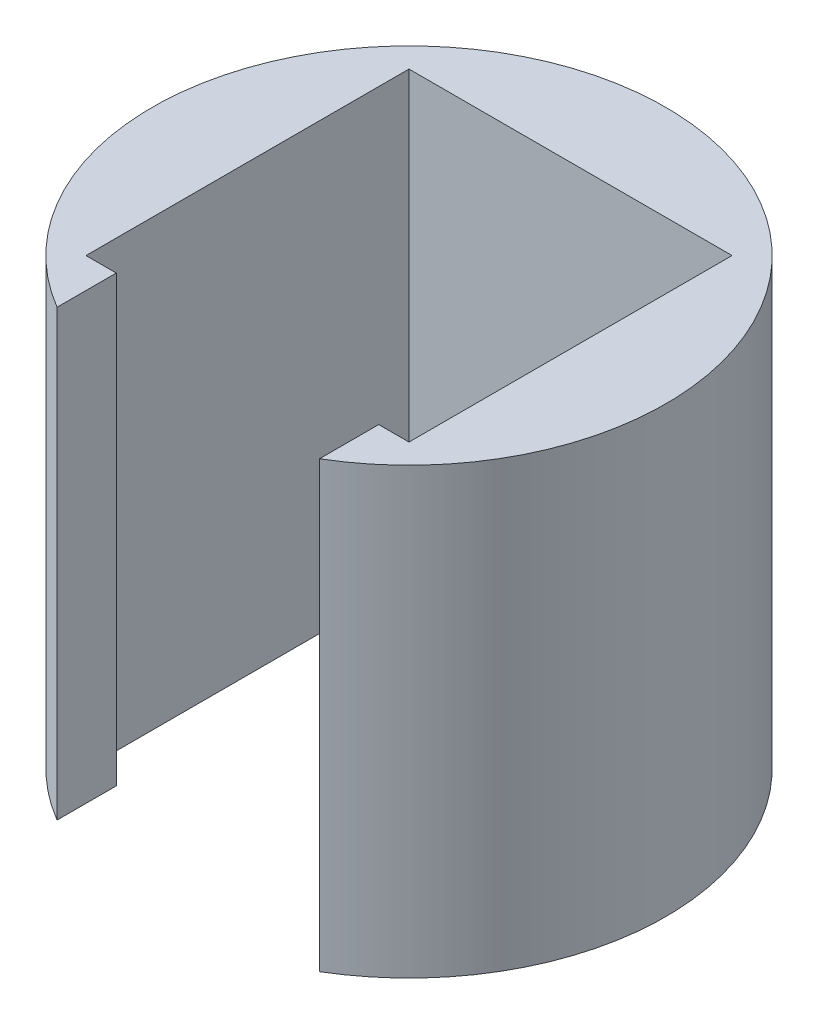
ISO-10303-21;
HEADER;
FILE_DESCRIPTION(('STEP AP214'),'2;1');
FILE_NAME('part.step','',(''),(''),'','','');
FILE_SCHEMA(('AUTOMOTIVE_DESIGN { 1 0 10303 214 1 1 1 1 }'));
ENDSEC;
DATA;
#1=APPLICATION_CONTEXT('core data for automotive mechanical design processes');
#2=APPLICATION_PROTOCOL_DEFINITION('international standard','automotive_design',2000,#1);
#3=PRODUCT_CONTEXT('',#1,'mechanical');
#4=PRODUCT('Part','Part','',(#3));
#5=PRODUCT_RELATED_PRODUCT_CATEGORY('part','',(#4));
#6=PRODUCT_DEFINITION_FORMATION('','',#4);
#7=PRODUCT_DEFINITION_CONTEXT('part definition',#1,'design');
#8=PRODUCT_DEFINITION('design','',#6,#7);
#9=PRODUCT_DEFINITION_SHAPE('','',#8);
#10=(LENGTH_UNIT() NAMED_UNIT(*) SI_UNIT(.MILLI.,.METRE.));
#11=(NAMED_UNIT(*) PLANE_ANGLE_UNIT() SI_UNIT($,.RADIAN.));
#12=(NAMED_UNIT(*) SI_UNIT($,.STERADIAN.) SOLID_ANGLE_UNIT());
#13=UNCERTAINTY_MEASURE_WITH_UNIT(LENGTH_MEASURE(1.E-05),#10,'distance_accuracy_value','');
#14=(GEOMETRIC_REPRESENTATION_CONTEXT(3) GLOBAL_UNCERTAINTY_ASSIGNED_CONTEXT((#13)) GLOBAL_UNIT_ASSIGNED_CONTEXT((#10,
#11,#12)) REPRESENTATION_CONTEXT('',''));
#15=CARTESIAN_POINT('',(0.,0.,0.));
#16=DIRECTION('',(0.,0.,1.));
#17=DIRECTION('',(1.,0.,0.));
#18=AXIS2_PLACEMENT_3D('',#15,#16,#17);
#19=CARTESIAN_POINT('',(6.5,22.,0.));
#20=DIRECTION('',(-1.,0.,0.));
#21=DIRECTION('',(0.,0.,1.));
#22=AXIS2_PLACEMENT_3D('',#19,#20,#21);
#23=PLANE('',#22);
#24=DIRECTION('',(0.,0.,-1.));
#25=VECTOR('',#24,1.);
#26=CARTESIAN_POINT('',(6.5,0.,0.));
#27=LINE('',#26,#25);
#28=CARTESIAN_POINT('',(6.5,0.,10.9338190949));
#29=VERTEX_POINT('',#28);
#30=CARTESIAN_POINT('',(6.5,0.,8.));
#31=VERTEX_POINT('',#30);
#32=EDGE_CURVE('E132',#29,#31,#27,.T.);
#33=ORIENTED_EDGE('',*,*,#32,.F.);
#34=DIRECTION('',(0.,-1.,0.));
#35=VECTOR('',#34,1.);
#36=CARTESIAN_POINT('',(6.5,22.,10.9338190949));
#37=LINE('',#36,#35);
#38=CARTESIAN_POINT('',(6.5,22.,10.9338190949));
#39=VERTEX_POINT('',#38);
#40=EDGE_CURVE('E11',#39,#29,#37,.T.);
#41=ORIENTED_EDGE('',*,*,#40,.F.);
#42=DIRECTION('',(0.,0.,-1.));
#43=VECTOR('',#42,1.);
#44=CARTESIAN_POINT('',(6.5,22.,0.));
#45=LINE('',#44,#43);
#46=CARTESIAN_POINT('',(6.5,22.,8.));
#47=VERTEX_POINT('',#46);
#48=EDGE_CURVE('E152',#39,#47,#45,.T.);
#49=ORIENTED_EDGE('',*,*,#48,.T.);
#50=DIRECTION('',(0.,-1.,0.));
#51=VECTOR('',#50,1.);
#52=CARTESIAN_POINT('',(6.5,22.,8.));
#53=LINE('',#52,#51);
#54=EDGE_CURVE('E54',#47,#31,#53,.T.);
#55=ORIENTED_EDGE('',*,*,#54,.T.);
#56=EDGE_LOOP('',(#33,#41,#49,#55));
#57=FACE_BOUND('',#56,.T.);
#58=ADVANCED_FACE('F38',(#57),#23,.T.);
#59=CARTESIAN_POINT('',(0.,22.,0.));
#60=DIRECTION('',(0.,-1.,0.));
#61=DIRECTION('',(0.,0.,-1.));
#62=AXIS2_PLACEMENT_3D('',#59,#60,#61);
#63=CYLINDRICAL_SURFACE('',#62,12.72);
#64=CARTESIAN_POINT('',(0.,0.,0.));
#65=DIRECTION('',(0.,1.,0.));
#66=DIRECTION('',(0.,0.,1.));
#67=AXIS2_PLACEMENT_3D('',#64,#65,#66);
#68=CIRCLE('',#67,12.72);
#69=CARTESIAN_POINT('',(-6.5,0.,10.9338190949));
#70=VERTEX_POINT('',#69);
#71=EDGE_CURVE('E134',#29,#70,#68,.T.);
#72=ORIENTED_EDGE('',*,*,#71,.T.);
#73=DIRECTION('',(0.,-1.,0.));
#74=VECTOR('',#73,1.);
#75=CARTESIAN_POINT('',(-6.5,22.,10.9338190949));
#76=LINE('',#75,#74);
#77=CARTESIAN_POINT('',(-6.5,22.,10.9338190949));
#78=VERTEX_POINT('',#77);
#79=EDGE_CURVE('E46',#78,#70,#76,.T.);
#80=ORIENTED_EDGE('',*,*,#79,.F.);
#81=CARTESIAN_POINT('',(0.,22.,0.));
#82=DIRECTION('',(0.,1.,0.));
#83=DIRECTION('',(0.,0.,1.));
#84=AXIS2_PLACEMENT_3D('',#81,#82,#83);
#85=CIRCLE('',#84,12.72);
#86=EDGE_CURVE('E177',#39,#78,#85,.T.);
#87=ORIENTED_EDGE('',*,*,#86,.F.);
#88=ORIENTED_EDGE('',*,*,#40,.T.);
#89=EDGE_LOOP('',(#72,#80,#87,#88));
#90=FACE_BOUND('',#89,.T.);
#91=ADVANCED_FACE('F168',(#90),#63,.T.);
#92=CARTESIAN_POINT('',(-6.5,22.,0.));
#93=DIRECTION('',(1.,0.,0.));
#94=DIRECTION('',(0.,0.,-1.));
#95=AXIS2_PLACEMENT_3D('',#92,#93,#94);
#96=PLANE('',#95);
#97=DIRECTION('',(0.,0.,1.));
#98=VECTOR('',#97,1.);
#99=CARTESIAN_POINT('',(-6.5,0.,0.));
#100=LINE('',#99,#98);
#101=CARTESIAN_POINT('',(-6.5,0.,8.));
#102=VERTEX_POINT('',#101);
#103=EDGE_CURVE('E137',#102,#70,#100,.T.);
#104=ORIENTED_EDGE('',*,*,#103,.F.);
#105=DIRECTION('',(0.,-1.,0.));
#106=VECTOR('',#105,1.);
#107=CARTESIAN_POINT('',(-6.5,22.,8.));
#108=LINE('',#107,#106);
#109=CARTESIAN_POINT('',(-6.5,22.,8.));
#110=VERTEX_POINT('',#109);
#111=EDGE_CURVE('E158',#110,#102,#108,.T.);
#112=ORIENTED_EDGE('',*,*,#111,.F.);
#113=DIRECTION('',(0.,0.,1.));
#114=VECTOR('',#113,1.);
#115=CARTESIAN_POINT('',(-6.5,22.,0.));
#116=LINE('',#115,#114);
#117=EDGE_CURVE('E165',#110,#78,#116,.T.);
#118=ORIENTED_EDGE('',*,*,#117,.T.);
#119=ORIENTED_EDGE('',*,*,#79,.T.);
#120=EDGE_LOOP('',(#104,#112,#118,#119));
#121=FACE_BOUND('',#120,.T.);
#122=ADVANCED_FACE('F163',(#121),#96,.T.);
#123=CARTESIAN_POINT('',(0.,22.,8.));
#124=DIRECTION('',(0.,0.,-1.));
#125=DIRECTION('',(-1.,0.,0.));
#126=AXIS2_PLACEMENT_3D('',#123,#124,#125);
#127=PLANE('',#126);
#128=DIRECTION('',(1.,0.,0.));
#129=VECTOR('',#128,1.);
#130=CARTESIAN_POINT('',(0.,0.,8.));
#131=LINE('',#130,#129);
#132=CARTESIAN_POINT('',(-8.,0.,8.));
#133=VERTEX_POINT('',#132);
#134=EDGE_CURVE('E140',#133,#102,#131,.T.);
#135=ORIENTED_EDGE('',*,*,#134,.F.);
#136=DIRECTION('',(0.,-1.,0.));
#137=VECTOR('',#136,1.);
#138=CARTESIAN_POINT('',(-8.,22.,8.));
#139=LINE('',#138,#137);
#140=CARTESIAN_POINT('',(-8.,22.,8.));
#141=VERTEX_POINT('',#140);
#142=EDGE_CURVE('E156',#141,#133,#139,.T.);
#143=ORIENTED_EDGE('',*,*,#142,.F.);
#144=DIRECTION('',(1.,0.,0.));
#145=VECTOR('',#144,1.);
#146=CARTESIAN_POINT('',(0.,22.,8.));
#147=LINE('',#146,#145);
#148=EDGE_CURVE('E176',#141,#110,#147,.T.);
#149=ORIENTED_EDGE('',*,*,#148,.T.);
#150=ORIENTED_EDGE('',*,*,#111,.T.);
#151=EDGE_LOOP('',(#135,#143,#149,#150));
#152=FACE_BOUND('',#151,.T.);
#153=ADVANCED_FACE('F174',(#152),#127,.T.);
#154=CARTESIAN_POINT('',(-8.,22.,0.));
#155=DIRECTION('',(1.,0.,0.));
#156=DIRECTION('',(0.,0.,-1.));
#157=AXIS2_PLACEMENT_3D('',#154,#155,#156);
#158=PLANE('',#157);
#159=DIRECTION('',(0.,0.,1.));
#160=VECTOR('',#159,1.);
#161=CARTESIAN_POINT('',(-8.,0.,0.));
#162=LINE('',#161,#160);
#163=CARTESIAN_POINT('',(-8.,0.,-8.));
#164=VERTEX_POINT('',#163);
#165=EDGE_CURVE('E143',#164,#133,#162,.T.);
#166=ORIENTED_EDGE('',*,*,#165,.F.);
#167=DIRECTION('',(0.,-1.,0.));
#168=VECTOR('',#167,1.);
#169=CARTESIAN_POINT('',(-8.,22.,-8.));
#170=LINE('',#169,#168);
#171=CARTESIAN_POINT('',(-8.,22.,-8.));
#172=VERTEX_POINT('',#171);
#173=EDGE_CURVE('E124',#172,#164,#170,.T.);
#174=ORIENTED_EDGE('',*,*,#173,.F.);
#175=DIRECTION('',(0.,0.,1.));
#176=VECTOR('',#175,1.);
#177=CARTESIAN_POINT('',(-8.,22.,0.));
#178=LINE('',#177,#176);
#179=EDGE_CURVE('E114',#172,#141,#178,.T.);
#180=ORIENTED_EDGE('',*,*,#179,.T.);
#181=ORIENTED_EDGE('',*,*,#142,.T.);
#182=EDGE_LOOP('',(#166,#174,#180,#181));
#183=FACE_BOUND('',#182,.T.);
#184=ADVANCED_FACE('F183',(#183),#158,.T.);
#185=CARTESIAN_POINT('',(0.,22.,-8.));
#186=DIRECTION('',(0.,0.,-1.));
#187=DIRECTION('',(-1.,0.,0.));
#188=AXIS2_PLACEMENT_3D('',#185,#186,#187);
#189=PLANE('',#188);
#190=DIRECTION('',(1.,0.,0.));
#191=VECTOR('',#190,1.);
#192=CARTESIAN_POINT('',(0.,0.,-8.));
#193=LINE('',#192,#191);
#194=CARTESIAN_POINT('',(8.,0.,-8.));
#195=VERTEX_POINT('',#194);
#196=EDGE_CURVE('E121',#164,#195,#193,.T.);
#197=ORIENTED_EDGE('',*,*,#196,.T.);
#198=DIRECTION('',(0.,-1.,0.));
#199=VECTOR('',#198,1.);
#200=CARTESIAN_POINT('',(8.,22.,-8.));
#201=LINE('',#200,#199);
#202=CARTESIAN_POINT('',(8.,22.,-8.));
#203=VERTEX_POINT('',#202);
#204=EDGE_CURVE('E118',#203,#195,#201,.T.);
#205=ORIENTED_EDGE('',*,*,#204,.F.);
#206=DIRECTION('',(1.,0.,0.));
#207=VECTOR('',#206,1.);
#208=CARTESIAN_POINT('',(0.,22.,-8.));
#209=LINE('',#208,#207);
#210=EDGE_CURVE('E105',#172,#203,#209,.T.);
#211=ORIENTED_EDGE('',*,*,#210,.F.);
#212=ORIENTED_EDGE('',*,*,#173,.T.);
#213=EDGE_LOOP('',(#197,#205,#211,#212));
#214=FACE_BOUND('',#213,.T.);
#215=ADVANCED_FACE('F119',(#214),#189,.F.);
#216=CARTESIAN_POINT('',(8.,22.,0.));
#217=DIRECTION('',(1.,0.,0.));
#218=DIRECTION('',(0.,0.,-1.));
#219=AXIS2_PLACEMENT_3D('',#216,#217,#218);
#220=PLANE('',#219);
#221=DIRECTION('',(0.,0.,1.));
#222=VECTOR('',#221,1.);
#223=CARTESIAN_POINT('',(8.,0.,0.));
#224=LINE('',#223,#222);
#225=CARTESIAN_POINT('',(8.,0.,8.));
#226=VERTEX_POINT('',#225);
#227=EDGE_CURVE('E147',#195,#226,#224,.T.);
#228=ORIENTED_EDGE('',*,*,#227,.T.);
#229=DIRECTION('',(0.,-1.,0.));
#230=VECTOR('',#229,1.);
#231=CARTESIAN_POINT('',(8.,22.,8.));
#232=LINE('',#231,#230);
#233=CARTESIAN_POINT('',(8.,22.,8.));
#234=VERTEX_POINT('',#233);
#235=EDGE_CURVE('E80',#234,#226,#232,.T.);
#236=ORIENTED_EDGE('',*,*,#235,.F.);
#237=DIRECTION('',(0.,0.,1.));
#238=VECTOR('',#237,1.);
#239=CARTESIAN_POINT('',(8.,22.,0.));
#240=LINE('',#239,#238);
#241=EDGE_CURVE('E111',#203,#234,#240,.T.);
#242=ORIENTED_EDGE('',*,*,#241,.F.);
#243=ORIENTED_EDGE('',*,*,#204,.T.);
#244=EDGE_LOOP('',(#228,#236,#242,#243));
#245=FACE_BOUND('',#244,.T.);
#246=ADVANCED_FACE('F126',(#245),#220,.F.);
#247=CARTESIAN_POINT('',(0.,22.,8.));
#248=DIRECTION('',(0.,0.,-1.));
#249=DIRECTION('',(-1.,0.,0.));
#250=AXIS2_PLACEMENT_3D('',#247,#248,#249);
#251=PLANE('',#250);
#252=DIRECTION('',(1.,0.,0.));
#253=VECTOR('',#252,1.);
#254=CARTESIAN_POINT('',(0.,0.,8.));
#255=LINE('',#254,#253);
#256=EDGE_CURVE('E149',#31,#226,#255,.T.);
#257=ORIENTED_EDGE('',*,*,#256,.F.);
#258=ORIENTED_EDGE('',*,*,#54,.F.);
#259=DIRECTION('',(1.,0.,0.));
#260=VECTOR('',#259,1.);
#261=CARTESIAN_POINT('',(0.,22.,8.));
#262=LINE('',#261,#260);
#263=EDGE_CURVE('E127',#47,#234,#262,.T.);
#264=ORIENTED_EDGE('',*,*,#263,.T.);
#265=ORIENTED_EDGE('',*,*,#235,.T.);
#266=EDGE_LOOP('',(#257,#258,#264,#265));
#267=FACE_BOUND('',#266,.T.);
#268=ADVANCED_FACE('F184',(#267),#251,.T.);
#269=CARTESIAN_POINT('',(0.,22.,0.));
#270=DIRECTION('',(0.,1.,0.));
#271=DIRECTION('',(0.,0.,1.));
#272=AXIS2_PLACEMENT_3D('',#269,#270,#271);
#273=PLANE('',#272);
#274=ORIENTED_EDGE('',*,*,#48,.F.);
#275=ORIENTED_EDGE('',*,*,#86,.T.);
#276=ORIENTED_EDGE('',*,*,#117,.F.);
#277=ORIENTED_EDGE('',*,*,#148,.F.);
#278=ORIENTED_EDGE('',*,*,#179,.F.);
#279=ORIENTED_EDGE('',*,*,#210,.T.);
#280=ORIENTED_EDGE('',*,*,#241,.T.);
#281=ORIENTED_EDGE('',*,*,#263,.F.);
#282=EDGE_LOOP('',(#274,#275,#276,#277,#278,#279,#280,#281));
#283=FACE_BOUND('',#282,.T.);
#284=ADVANCED_FACE('F108',(#283),#273,.T.);
#285=CARTESIAN_POINT('',(0.,0.,0.));
#286=DIRECTION('',(0.,1.,0.));
#287=DIRECTION('',(0.,0.,1.));
#288=AXIS2_PLACEMENT_3D('',#285,#286,#287);
#289=PLANE('',#288);
#290=ORIENTED_EDGE('',*,*,#32,.T.);
#291=ORIENTED_EDGE('',*,*,#256,.T.);
#292=ORIENTED_EDGE('',*,*,#227,.F.);
#293=ORIENTED_EDGE('',*,*,#196,.F.);
#294=ORIENTED_EDGE('',*,*,#165,.T.);
#295=ORIENTED_EDGE('',*,*,#134,.T.);
#296=ORIENTED_EDGE('',*,*,#103,.T.);
#297=ORIENTED_EDGE('',*,*,#71,.F.);
#298=EDGE_LOOP('',(#290,#291,#292,#293,#294,#295,#296,#297));
#299=FACE_BOUND('',#298,.T.);
#300=ADVANCED_FACE('F170',(#299),#289,.F.);
#301=CLOSED_SHELL('',(#58,#91,#122,#153,#184,#215,#246,#268,#284,#300));
#302=MANIFOLD_SOLID_BREP('B2',#301);
#303=ADVANCED_BREP_SHAPE_REPRESENTATION('',(#18,#302),#14);
#304=SHAPE_DEFINITION_REPRESENTATION(#9,#303);
ENDSEC;
END-ISO-10303-21;
